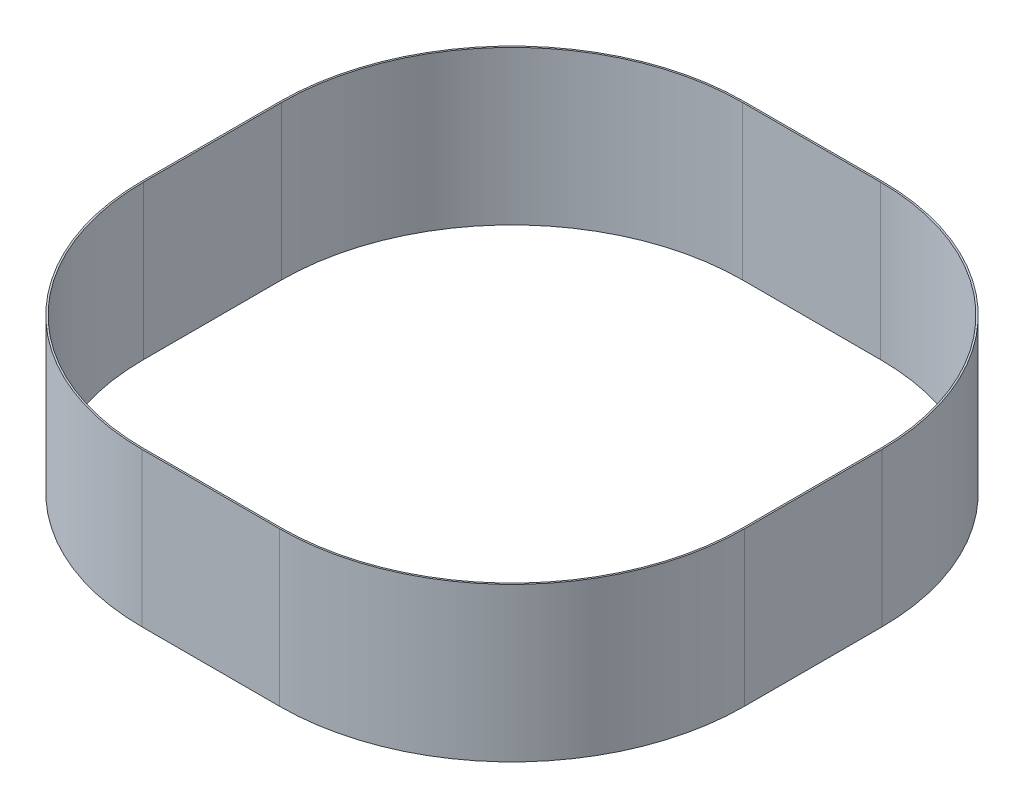
ISO-10303-21;
HEADER;
FILE_DESCRIPTION(('STEP AP214'),'2;1');
FILE_NAME('part.step','',(''),(''),'','','');
FILE_SCHEMA(('AUTOMOTIVE_DESIGN { 1 0 10303 214 1 1 1 1 }'));
ENDSEC;
DATA;
#1=APPLICATION_CONTEXT('core data for automotive mechanical design processes');
#2=APPLICATION_PROTOCOL_DEFINITION('international standard','automotive_design',2000,#1);
#3=PRODUCT_CONTEXT('',#1,'mechanical');
#4=PRODUCT('Part','Part','',(#3));
#5=PRODUCT_RELATED_PRODUCT_CATEGORY('part','',(#4));
#6=PRODUCT_DEFINITION_FORMATION('','',#4);
#7=PRODUCT_DEFINITION_CONTEXT('part definition',#1,'design');
#8=PRODUCT_DEFINITION('design','',#6,#7);
#9=PRODUCT_DEFINITION_SHAPE('','',#8);
#10=(LENGTH_UNIT() NAMED_UNIT(*) SI_UNIT(.MILLI.,.METRE.));
#11=(NAMED_UNIT(*) PLANE_ANGLE_UNIT() SI_UNIT($,.RADIAN.));
#12=(NAMED_UNIT(*) SI_UNIT($,.STERADIAN.) SOLID_ANGLE_UNIT());
#13=UNCERTAINTY_MEASURE_WITH_UNIT(LENGTH_MEASURE(1.E-05),#10,'distance_accuracy_value','');
#14=(GEOMETRIC_REPRESENTATION_CONTEXT(3) GLOBAL_UNCERTAINTY_ASSIGNED_CONTEXT((#13)) GLOBAL_UNIT_ASSIGNED_CONTEXT((#10,
#11,#12)) REPRESENTATION_CONTEXT('',''));
#15=CARTESIAN_POINT('',(0.,0.,0.));
#16=DIRECTION('',(0.,0.,1.));
#17=DIRECTION('',(1.,0.,0.));
#18=AXIS2_PLACEMENT_3D('',#15,#16,#17);
#19=CARTESIAN_POINT('',(-34.13125,76.2,-34.13125));
#20=DIRECTION('',(0.,-1.,0.));
#21=DIRECTION('',(0.,0.,-1.));
#22=AXIS2_PLACEMENT_3D('',#19,#20,#21);
#23=PLANE('',#22);
#24=CARTESIAN_POINT('',(-34.13125,76.2,-34.13125));
#25=DIRECTION('',(0.,1.,0.));
#26=DIRECTION('',(0.,0.,-1.));
#27=AXIS2_PLACEMENT_3D('',#24,#25,#26);
#28=CIRCLE('',#27,115.09375);
#29=CARTESIAN_POINT('',(-34.13125,76.2,-149.225));
#30=VERTEX_POINT('',#29);
#31=CARTESIAN_POINT('',(-149.225,76.2,-34.13125));
#32=VERTEX_POINT('',#31);
#33=EDGE_CURVE('E242',#30,#32,#28,.T.);
#34=ORIENTED_EDGE('',*,*,#33,.T.);
#35=DIRECTION('',(0.,0.,1.));
#36=VECTOR('',#35,1.);
#37=CARTESIAN_POINT('',(-149.225,76.2,34.13125));
#38=LINE('',#37,#36);
#39=CARTESIAN_POINT('',(-149.225,76.2,34.13125));
#40=VERTEX_POINT('',#39);
#41=EDGE_CURVE('E246',#32,#40,#38,.T.);
#42=ORIENTED_EDGE('',*,*,#41,.T.);
#43=CARTESIAN_POINT('',(-34.13125,76.2,34.13125));
#44=DIRECTION('',(0.,1.,0.));
#45=DIRECTION('',(0.,0.,-1.));
#46=AXIS2_PLACEMENT_3D('',#43,#44,#45);
#47=CIRCLE('',#46,115.09375);
#48=CARTESIAN_POINT('',(-34.13125,76.2,149.225));
#49=VERTEX_POINT('',#48);
#50=EDGE_CURVE('E250',#40,#49,#47,.T.);
#51=ORIENTED_EDGE('',*,*,#50,.T.);
#52=DIRECTION('',(1.,0.,0.));
#53=VECTOR('',#52,1.);
#54=CARTESIAN_POINT('',(-34.13125,76.2,149.225));
#55=LINE('',#54,#53);
#56=CARTESIAN_POINT('',(34.13125,76.2,149.225));
#57=VERTEX_POINT('',#56);
#58=EDGE_CURVE('E253',#49,#57,#55,.T.);
#59=ORIENTED_EDGE('',*,*,#58,.T.);
#60=CARTESIAN_POINT('',(34.1312500000001,76.2,34.13125));
#61=DIRECTION('',(0.,1.,0.));
#62=DIRECTION('',(0.,0.,1.));
#63=AXIS2_PLACEMENT_3D('',#60,#61,#62);
#64=CIRCLE('',#63,115.09375);
#65=CARTESIAN_POINT('',(149.225,76.2,34.13125));
#66=VERTEX_POINT('',#65);
#67=EDGE_CURVE('E256',#57,#66,#64,.T.);
#68=ORIENTED_EDGE('',*,*,#67,.T.);
#69=DIRECTION('',(0.,0.,-1.));
#70=VECTOR('',#69,1.);
#71=CARTESIAN_POINT('',(149.225,76.2,34.13125));
#72=LINE('',#71,#70);
#73=CARTESIAN_POINT('',(149.225,76.2,-34.13125));
#74=VERTEX_POINT('',#73);
#75=EDGE_CURVE('E259',#66,#74,#72,.T.);
#76=ORIENTED_EDGE('',*,*,#75,.T.);
#77=CARTESIAN_POINT('',(34.1312500000001,76.2,-34.13125));
#78=DIRECTION('',(0.,1.,0.));
#79=DIRECTION('',(0.,0.,-1.));
#80=AXIS2_PLACEMENT_3D('',#77,#78,#79);
#81=CIRCLE('',#80,115.09375);
#82=CARTESIAN_POINT('',(34.1312500000001,76.2,-149.225));
#83=VERTEX_POINT('',#82);
#84=EDGE_CURVE('E262',#74,#83,#81,.T.);
#85=ORIENTED_EDGE('',*,*,#84,.T.);
#86=DIRECTION('',(-1.,0.,0.));
#87=VECTOR('',#86,1.);
#88=CARTESIAN_POINT('',(-34.13125,76.2,-149.225));
#89=LINE('',#88,#87);
#90=EDGE_CURVE('E265',#83,#30,#89,.T.);
#91=ORIENTED_EDGE('',*,*,#90,.T.);
#92=EDGE_LOOP('',(#34,#42,#51,#59,#68,#76,#85,#91));
#93=FACE_BOUND('',#92,.T.);
#94=CARTESIAN_POINT('',(-34.13125,76.2,34.13125));
#95=DIRECTION('',(0.,1.,0.));
#96=DIRECTION('',(0.,0.,-1.));
#97=AXIS2_PLACEMENT_3D('',#94,#95,#96);
#98=CIRCLE('',#97,114.3);
#99=CARTESIAN_POINT('',(-148.43125,76.2,34.1312499999992));
#100=VERTEX_POINT('',#99);
#101=CARTESIAN_POINT('',(-34.1312499999991,76.2,148.43125));
#102=VERTEX_POINT('',#101);
#103=EDGE_CURVE('E153',#100,#102,#98,.T.);
#104=ORIENTED_EDGE('',*,*,#103,.F.);
#105=DIRECTION('',(0.,0.,1.));
#106=VECTOR('',#105,1.);
#107=CARTESIAN_POINT('',(-148.43125,76.2,34.1312499999992));
#108=LINE('',#107,#106);
#109=CARTESIAN_POINT('',(-148.43125,76.2,-34.1312499999992));
#110=VERTEX_POINT('',#109);
#111=EDGE_CURVE('E194',#110,#100,#108,.T.);
#112=ORIENTED_EDGE('',*,*,#111,.F.);
#113=CARTESIAN_POINT('',(-34.13125,76.2,-34.13125));
#114=DIRECTION('',(0.,1.,0.));
#115=DIRECTION('',(0.,0.,-1.));
#116=AXIS2_PLACEMENT_3D('',#113,#114,#115);
#117=CIRCLE('',#116,114.3);
#118=CARTESIAN_POINT('',(-34.1312499999992,76.2,-148.43125));
#119=VERTEX_POINT('',#118);
#120=EDGE_CURVE('E191',#119,#110,#117,.T.);
#121=ORIENTED_EDGE('',*,*,#120,.F.);
#122=DIRECTION('',(-1.,0.,0.));
#123=VECTOR('',#122,1.);
#124=CARTESIAN_POINT('',(-34.1312499999992,76.2,-148.43125));
#125=LINE('',#124,#123);
#126=CARTESIAN_POINT('',(34.1312499999992,76.2,-148.43125));
#127=VERTEX_POINT('',#126);
#128=EDGE_CURVE('E188',#127,#119,#125,.T.);
#129=ORIENTED_EDGE('',*,*,#128,.F.);
#130=CARTESIAN_POINT('',(34.1312500000001,76.2,-34.13125));
#131=DIRECTION('',(0.,1.,0.));
#132=DIRECTION('',(0.,0.,-1.));
#133=AXIS2_PLACEMENT_3D('',#130,#131,#132);
#134=CIRCLE('',#133,114.3);
#135=CARTESIAN_POINT('',(148.43125,76.2,-34.1312499999992));
#136=VERTEX_POINT('',#135);
#137=EDGE_CURVE('E185',#136,#127,#134,.T.);
#138=ORIENTED_EDGE('',*,*,#137,.F.);
#139=DIRECTION('',(0.,0.,-1.));
#140=VECTOR('',#139,1.);
#141=CARTESIAN_POINT('',(148.43125,76.2,34.1312499999992));
#142=LINE('',#141,#140);
#143=CARTESIAN_POINT('',(148.43125,76.2,34.1312499999992));
#144=VERTEX_POINT('',#143);
#145=EDGE_CURVE('E180',#144,#136,#142,.T.);
#146=ORIENTED_EDGE('',*,*,#145,.F.);
#147=CARTESIAN_POINT('',(34.1312500000001,76.2,34.13125));
#148=DIRECTION('',(0.,1.,0.));
#149=DIRECTION('',(0.,0.,1.));
#150=AXIS2_PLACEMENT_3D('',#147,#148,#149);
#151=CIRCLE('',#150,114.3);
#152=CARTESIAN_POINT('',(34.1312499999992,76.2,148.43125));
#153=VERTEX_POINT('',#152);
#154=EDGE_CURVE('E176',#153,#144,#151,.T.);
#155=ORIENTED_EDGE('',*,*,#154,.F.);
#156=DIRECTION('',(1.,0.,0.));
#157=VECTOR('',#156,1.);
#158=CARTESIAN_POINT('',(-34.1312499999991,76.2,148.43125));
#159=LINE('',#158,#157);
#160=EDGE_CURVE('E162',#102,#153,#159,.T.);
#161=ORIENTED_EDGE('',*,*,#160,.F.);
#162=EDGE_LOOP('',(#104,#112,#121,#129,#138,#146,#155,#161));
#163=FACE_BOUND('',#162,.T.);
#164=ADVANCED_FACE('F39',(#93,#163),#23,.F.);
#165=CARTESIAN_POINT('',(-34.13125,0.,-34.13125));
#166=DIRECTION('',(0.,-1.,0.));
#167=DIRECTION('',(0.,0.,-1.));
#168=AXIS2_PLACEMENT_3D('',#165,#166,#167);
#169=PLANE('',#168);
#170=CARTESIAN_POINT('',(-34.13125,0.,-34.13125));
#171=DIRECTION('',(0.,1.,0.));
#172=DIRECTION('',(0.,0.,-1.));
#173=AXIS2_PLACEMENT_3D('',#170,#171,#172);
#174=CIRCLE('',#173,115.09375);
#175=CARTESIAN_POINT('',(-34.13125,0.,-149.225));
#176=VERTEX_POINT('',#175);
#177=CARTESIAN_POINT('',(-149.225,0.,-34.13125));
#178=VERTEX_POINT('',#177);
#179=EDGE_CURVE('E171',#176,#178,#174,.T.);
#180=ORIENTED_EDGE('',*,*,#179,.F.);
#181=DIRECTION('',(-1.,0.,0.));
#182=VECTOR('',#181,1.);
#183=CARTESIAN_POINT('',(-34.13125,0.,-149.225));
#184=LINE('',#183,#182);
#185=CARTESIAN_POINT('',(34.1312500000001,0.,-149.225));
#186=VERTEX_POINT('',#185);
#187=EDGE_CURVE('E247',#186,#176,#184,.T.);
#188=ORIENTED_EDGE('',*,*,#187,.F.);
#189=CARTESIAN_POINT('',(34.1312500000001,0.,-34.13125));
#190=DIRECTION('',(0.,1.,0.));
#191=DIRECTION('',(0.,0.,-1.));
#192=AXIS2_PLACEMENT_3D('',#189,#190,#191);
#193=CIRCLE('',#192,115.09375);
#194=CARTESIAN_POINT('',(149.225,0.,-34.13125));
#195=VERTEX_POINT('',#194);
#196=EDGE_CURVE('E287',#195,#186,#193,.T.);
#197=ORIENTED_EDGE('',*,*,#196,.F.);
#198=DIRECTION('',(0.,0.,-1.));
#199=VECTOR('',#198,1.);
#200=CARTESIAN_POINT('',(149.225,0.,34.13125));
#201=LINE('',#200,#199);
#202=CARTESIAN_POINT('',(149.225,0.,34.13125));
#203=VERTEX_POINT('',#202);
#204=EDGE_CURVE('E284',#203,#195,#201,.T.);
#205=ORIENTED_EDGE('',*,*,#204,.F.);
#206=CARTESIAN_POINT('',(34.1312500000001,0.,34.13125));
#207=DIRECTION('',(0.,1.,0.));
#208=DIRECTION('',(0.,0.,1.));
#209=AXIS2_PLACEMENT_3D('',#206,#207,#208);
#210=CIRCLE('',#209,115.09375);
#211=CARTESIAN_POINT('',(34.13125,0.,149.225));
#212=VERTEX_POINT('',#211);
#213=EDGE_CURVE('E281',#212,#203,#210,.T.);
#214=ORIENTED_EDGE('',*,*,#213,.F.);
#215=DIRECTION('',(1.,0.,0.));
#216=VECTOR('',#215,1.);
#217=CARTESIAN_POINT('',(-34.13125,0.,149.225));
#218=LINE('',#217,#216);
#219=CARTESIAN_POINT('',(-34.13125,0.,149.225));
#220=VERTEX_POINT('',#219);
#221=EDGE_CURVE('E278',#220,#212,#218,.T.);
#222=ORIENTED_EDGE('',*,*,#221,.F.);
#223=CARTESIAN_POINT('',(-34.13125,0.,34.13125));
#224=DIRECTION('',(0.,1.,0.));
#225=DIRECTION('',(0.,0.,-1.));
#226=AXIS2_PLACEMENT_3D('',#223,#224,#225);
#227=CIRCLE('',#226,115.09375);
#228=CARTESIAN_POINT('',(-149.225,0.,34.13125));
#229=VERTEX_POINT('',#228);
#230=EDGE_CURVE('E275',#229,#220,#227,.T.);
#231=ORIENTED_EDGE('',*,*,#230,.F.);
#232=DIRECTION('',(0.,0.,1.));
#233=VECTOR('',#232,1.);
#234=CARTESIAN_POINT('',(-149.225,0.,34.13125));
#235=LINE('',#234,#233);
#236=EDGE_CURVE('E272',#178,#229,#235,.T.);
#237=ORIENTED_EDGE('',*,*,#236,.F.);
#238=EDGE_LOOP('',(#180,#188,#197,#205,#214,#222,#231,#237));
#239=FACE_BOUND('',#238,.T.);
#240=DIRECTION('',(0.,0.,1.));
#241=VECTOR('',#240,1.);
#242=CARTESIAN_POINT('',(-148.43125,0.,34.1312499999992));
#243=LINE('',#242,#241);
#244=CARTESIAN_POINT('',(-148.43125,0.,-34.1312499999992));
#245=VERTEX_POINT('',#244);
#246=CARTESIAN_POINT('',(-148.43125,0.,34.1312499999992));
#247=VERTEX_POINT('',#246);
#248=EDGE_CURVE('E163',#245,#247,#243,.T.);
#249=ORIENTED_EDGE('',*,*,#248,.T.);
#250=CARTESIAN_POINT('',(-34.13125,0.,34.13125));
#251=DIRECTION('',(0.,1.,0.));
#252=DIRECTION('',(0.,0.,-1.));
#253=AXIS2_PLACEMENT_3D('',#250,#251,#252);
#254=CIRCLE('',#253,114.3);
#255=CARTESIAN_POINT('',(-34.1312499999991,0.,148.43125));
#256=VERTEX_POINT('',#255);
#257=EDGE_CURVE('E63',#247,#256,#254,.T.);
#258=ORIENTED_EDGE('',*,*,#257,.T.);
#259=DIRECTION('',(1.,0.,0.));
#260=VECTOR('',#259,1.);
#261=CARTESIAN_POINT('',(-34.1312499999991,0.,148.43125));
#262=LINE('',#261,#260);
#263=CARTESIAN_POINT('',(34.1312499999992,0.,148.43125));
#264=VERTEX_POINT('',#263);
#265=EDGE_CURVE('E169',#256,#264,#262,.T.);
#266=ORIENTED_EDGE('',*,*,#265,.T.);
#267=CARTESIAN_POINT('',(34.1312500000001,0.,34.13125));
#268=DIRECTION('',(0.,1.,0.));
#269=DIRECTION('',(0.,0.,1.));
#270=AXIS2_PLACEMENT_3D('',#267,#268,#269);
#271=CIRCLE('',#270,114.3);
#272=CARTESIAN_POINT('',(148.43125,0.,34.1312499999992));
#273=VERTEX_POINT('',#272);
#274=EDGE_CURVE('E201',#264,#273,#271,.T.);
#275=ORIENTED_EDGE('',*,*,#274,.T.);
#276=DIRECTION('',(0.,0.,-1.));
#277=VECTOR('',#276,1.);
#278=CARTESIAN_POINT('',(148.43125,0.,34.1312499999992));
#279=LINE('',#278,#277);
#280=CARTESIAN_POINT('',(148.43125,0.,-34.1312499999992));
#281=VERTEX_POINT('',#280);
#282=EDGE_CURVE('E205',#273,#281,#279,.T.);
#283=ORIENTED_EDGE('',*,*,#282,.T.);
#284=CARTESIAN_POINT('',(34.1312500000001,0.,-34.13125));
#285=DIRECTION('',(0.,1.,0.));
#286=DIRECTION('',(0.,0.,-1.));
#287=AXIS2_PLACEMENT_3D('',#284,#285,#286);
#288=CIRCLE('',#287,114.3);
#289=CARTESIAN_POINT('',(34.1312499999992,0.,-148.43125));
#290=VERTEX_POINT('',#289);
#291=EDGE_CURVE('E209',#281,#290,#288,.T.);
#292=ORIENTED_EDGE('',*,*,#291,.T.);
#293=DIRECTION('',(-1.,0.,0.));
#294=VECTOR('',#293,1.);
#295=CARTESIAN_POINT('',(-34.1312499999992,0.,-148.43125));
#296=LINE('',#295,#294);
#297=CARTESIAN_POINT('',(-34.1312499999992,0.,-148.43125));
#298=VERTEX_POINT('',#297);
#299=EDGE_CURVE('E213',#290,#298,#296,.T.);
#300=ORIENTED_EDGE('',*,*,#299,.T.);
#301=CARTESIAN_POINT('',(-34.13125,0.,-34.13125));
#302=DIRECTION('',(0.,1.,0.));
#303=DIRECTION('',(0.,0.,-1.));
#304=AXIS2_PLACEMENT_3D('',#301,#302,#303);
#305=CIRCLE('',#304,114.3);
#306=EDGE_CURVE('E217',#298,#245,#305,.T.);
#307=ORIENTED_EDGE('',*,*,#306,.T.);
#308=EDGE_LOOP('',(#249,#258,#266,#275,#283,#292,#300,#307));
#309=FACE_BOUND('',#308,.T.);
#310=ADVANCED_FACE('F326',(#239,#309),#169,.T.);
#311=CARTESIAN_POINT('',(-34.13125,76.2,-34.13125));
#312=DIRECTION('',(0.,-1.,0.));
#313=DIRECTION('',(0.,0.,-1.));
#314=AXIS2_PLACEMENT_3D('',#311,#312,#313);
#315=CYLINDRICAL_SURFACE('',#314,115.09375);
#316=ORIENTED_EDGE('',*,*,#179,.T.);
#317=DIRECTION('',(0.,-1.,0.));
#318=VECTOR('',#317,1.);
#319=CARTESIAN_POINT('',(-149.225,76.2,-34.13125));
#320=LINE('',#319,#318);
#321=EDGE_CURVE('E11',#32,#178,#320,.T.);
#322=ORIENTED_EDGE('',*,*,#321,.F.);
#323=ORIENTED_EDGE('',*,*,#33,.F.);
#324=DIRECTION('',(0.,-1.,0.));
#325=VECTOR('',#324,1.);
#326=CARTESIAN_POINT('',(-34.13125,76.2,-149.225));
#327=LINE('',#326,#325);
#328=EDGE_CURVE('E268',#30,#176,#327,.T.);
#329=ORIENTED_EDGE('',*,*,#328,.T.);
#330=EDGE_LOOP('',(#316,#322,#323,#329));
#331=FACE_BOUND('',#330,.T.);
#332=ADVANCED_FACE('F41',(#331),#315,.T.);
#333=CARTESIAN_POINT('',(-149.225,76.2,34.13125));
#334=DIRECTION('',(1.,0.,0.));
#335=DIRECTION('',(0.,0.,-1.));
#336=AXIS2_PLACEMENT_3D('',#333,#334,#335);
#337=PLANE('',#336);
#338=ORIENTED_EDGE('',*,*,#236,.T.);
#339=DIRECTION('',(0.,-1.,0.));
#340=VECTOR('',#339,1.);
#341=CARTESIAN_POINT('',(-149.225,76.2,34.13125));
#342=LINE('',#341,#340);
#343=EDGE_CURVE('E48',#40,#229,#342,.T.);
#344=ORIENTED_EDGE('',*,*,#343,.F.);
#345=ORIENTED_EDGE('',*,*,#41,.F.);
#346=ORIENTED_EDGE('',*,*,#321,.T.);
#347=EDGE_LOOP('',(#338,#344,#345,#346));
#348=FACE_BOUND('',#347,.T.);
#349=ADVANCED_FACE('F343',(#348),#337,.F.);
#350=CARTESIAN_POINT('',(-34.13125,76.2,34.13125));
#351=DIRECTION('',(0.,-1.,0.));
#352=DIRECTION('',(0.,0.,-1.));
#353=AXIS2_PLACEMENT_3D('',#350,#351,#352);
#354=CYLINDRICAL_SURFACE('',#353,115.09375);
#355=ORIENTED_EDGE('',*,*,#230,.T.);
#356=DIRECTION('',(0.,-1.,0.));
#357=VECTOR('',#356,1.);
#358=CARTESIAN_POINT('',(-34.13125,76.2,149.225));
#359=LINE('',#358,#357);
#360=EDGE_CURVE('E311',#49,#220,#359,.T.);
#361=ORIENTED_EDGE('',*,*,#360,.F.);
#362=ORIENTED_EDGE('',*,*,#50,.F.);
#363=ORIENTED_EDGE('',*,*,#343,.T.);
#364=EDGE_LOOP('',(#355,#361,#362,#363));
#365=FACE_BOUND('',#364,.T.);
#366=ADVANCED_FACE('F320',(#365),#354,.T.);
#367=CARTESIAN_POINT('',(-34.13125,76.2,149.225));
#368=DIRECTION('',(0.,0.,-1.));
#369=DIRECTION('',(-1.,0.,0.));
#370=AXIS2_PLACEMENT_3D('',#367,#368,#369);
#371=PLANE('',#370);
#372=ORIENTED_EDGE('',*,*,#221,.T.);
#373=DIRECTION('',(0.,-1.,0.));
#374=VECTOR('',#373,1.);
#375=CARTESIAN_POINT('',(34.13125,76.2,149.225));
#376=LINE('',#375,#374);
#377=EDGE_CURVE('E307',#57,#212,#376,.T.);
#378=ORIENTED_EDGE('',*,*,#377,.F.);
#379=ORIENTED_EDGE('',*,*,#58,.F.);
#380=ORIENTED_EDGE('',*,*,#360,.T.);
#381=EDGE_LOOP('',(#372,#378,#379,#380));
#382=FACE_BOUND('',#381,.T.);
#383=ADVANCED_FACE('F332',(#382),#371,.F.);
#384=CARTESIAN_POINT('',(34.1312500000001,76.2,34.13125));
#385=DIRECTION('',(0.,-1.,0.));
#386=DIRECTION('',(0.,0.,-1.));
#387=AXIS2_PLACEMENT_3D('',#384,#385,#386);
#388=CYLINDRICAL_SURFACE('',#387,115.09375);
#389=ORIENTED_EDGE('',*,*,#213,.T.);
#390=DIRECTION('',(0.,-1.,0.));
#391=VECTOR('',#390,1.);
#392=CARTESIAN_POINT('',(149.225,76.2,34.13125));
#393=LINE('',#392,#391);
#394=EDGE_CURVE('E303',#66,#203,#393,.T.);
#395=ORIENTED_EDGE('',*,*,#394,.F.);
#396=ORIENTED_EDGE('',*,*,#67,.F.);
#397=ORIENTED_EDGE('',*,*,#377,.T.);
#398=EDGE_LOOP('',(#389,#395,#396,#397));
#399=FACE_BOUND('',#398,.T.);
#400=ADVANCED_FACE('F336',(#399),#388,.T.);
#401=CARTESIAN_POINT('',(149.225,76.2,34.13125));
#402=DIRECTION('',(-1.,0.,0.));
#403=DIRECTION('',(0.,0.,1.));
#404=AXIS2_PLACEMENT_3D('',#401,#402,#403);
#405=PLANE('',#404);
#406=ORIENTED_EDGE('',*,*,#204,.T.);
#407=DIRECTION('',(0.,-1.,0.));
#408=VECTOR('',#407,1.);
#409=CARTESIAN_POINT('',(149.225,76.2,-34.13125));
#410=LINE('',#409,#408);
#411=EDGE_CURVE('E299',#74,#195,#410,.T.);
#412=ORIENTED_EDGE('',*,*,#411,.F.);
#413=ORIENTED_EDGE('',*,*,#75,.F.);
#414=ORIENTED_EDGE('',*,*,#394,.T.);
#415=EDGE_LOOP('',(#406,#412,#413,#414));
#416=FACE_BOUND('',#415,.T.);
#417=ADVANCED_FACE('F356',(#416),#405,.F.);
#418=CARTESIAN_POINT('',(34.1312500000001,76.2,-34.13125));
#419=DIRECTION('',(0.,-1.,0.));
#420=DIRECTION('',(0.,0.,-1.));
#421=AXIS2_PLACEMENT_3D('',#418,#419,#420);
#422=CYLINDRICAL_SURFACE('',#421,115.09375);
#423=ORIENTED_EDGE('',*,*,#196,.T.);
#424=DIRECTION('',(0.,-1.,0.));
#425=VECTOR('',#424,1.);
#426=CARTESIAN_POINT('',(34.1312500000001,76.2,-149.225));
#427=LINE('',#426,#425);
#428=EDGE_CURVE('E295',#83,#186,#427,.T.);
#429=ORIENTED_EDGE('',*,*,#428,.F.);
#430=ORIENTED_EDGE('',*,*,#84,.F.);
#431=ORIENTED_EDGE('',*,*,#411,.T.);
#432=EDGE_LOOP('',(#423,#429,#430,#431));
#433=FACE_BOUND('',#432,.T.);
#434=ADVANCED_FACE('F354',(#433),#422,.T.);
#435=CARTESIAN_POINT('',(-34.13125,76.2,-149.225));
#436=DIRECTION('',(0.,0.,1.));
#437=DIRECTION('',(1.,0.,0.));
#438=AXIS2_PLACEMENT_3D('',#435,#436,#437);
#439=PLANE('',#438);
#440=ORIENTED_EDGE('',*,*,#187,.T.);
#441=ORIENTED_EDGE('',*,*,#328,.F.);
#442=ORIENTED_EDGE('',*,*,#90,.F.);
#443=ORIENTED_EDGE('',*,*,#428,.T.);
#444=EDGE_LOOP('',(#440,#441,#442,#443));
#445=FACE_BOUND('',#444,.T.);
#446=ADVANCED_FACE('F349',(#445),#439,.F.);
#447=CARTESIAN_POINT('',(-34.13125,76.2,34.13125));
#448=DIRECTION('',(0.,-1.,0.));
#449=DIRECTION('',(0.,0.,-1.));
#450=AXIS2_PLACEMENT_3D('',#447,#448,#449);
#451=CYLINDRICAL_SURFACE('',#450,114.3);
#452=ORIENTED_EDGE('',*,*,#257,.F.);
#453=DIRECTION('',(0.,-1.,0.));
#454=VECTOR('',#453,1.);
#455=CARTESIAN_POINT('',(-148.43125,76.2,34.1312499999992));
#456=LINE('',#455,#454);
#457=EDGE_CURVE('E157',#100,#247,#456,.T.);
#458=ORIENTED_EDGE('',*,*,#457,.F.);
#459=ORIENTED_EDGE('',*,*,#103,.T.);
#460=DIRECTION('',(0.,-1.,0.));
#461=VECTOR('',#460,1.);
#462=CARTESIAN_POINT('',(-34.1312499999991,76.2,148.43125));
#463=LINE('',#462,#461);
#464=EDGE_CURVE('E156',#102,#256,#463,.T.);
#465=ORIENTED_EDGE('',*,*,#464,.T.);
#466=EDGE_LOOP('',(#452,#458,#459,#465));
#467=FACE_BOUND('',#466,.T.);
#468=ADVANCED_FACE('F155',(#467),#451,.F.);
#469=CARTESIAN_POINT('',(-34.1312499999991,76.2,148.43125));
#470=DIRECTION('',(0.,0.,-1.));
#471=DIRECTION('',(-1.,0.,0.));
#472=AXIS2_PLACEMENT_3D('',#469,#470,#471);
#473=PLANE('',#472);
#474=ORIENTED_EDGE('',*,*,#265,.F.);
#475=ORIENTED_EDGE('',*,*,#464,.F.);
#476=ORIENTED_EDGE('',*,*,#160,.T.);
#477=DIRECTION('',(0.,-1.,0.));
#478=VECTOR('',#477,1.);
#479=CARTESIAN_POINT('',(34.1312499999992,76.2,148.43125));
#480=LINE('',#479,#478);
#481=EDGE_CURVE('E172',#153,#264,#480,.T.);
#482=ORIENTED_EDGE('',*,*,#481,.T.);
#483=EDGE_LOOP('',(#474,#475,#476,#482));
#484=FACE_BOUND('',#483,.T.);
#485=ADVANCED_FACE('F166',(#484),#473,.T.);
#486=CARTESIAN_POINT('',(34.1312500000001,76.2,34.13125));
#487=DIRECTION('',(0.,-1.,0.));
#488=DIRECTION('',(0.,0.,-1.));
#489=AXIS2_PLACEMENT_3D('',#486,#487,#488);
#490=CYLINDRICAL_SURFACE('',#489,114.3);
#491=ORIENTED_EDGE('',*,*,#274,.F.);
#492=ORIENTED_EDGE('',*,*,#481,.F.);
#493=ORIENTED_EDGE('',*,*,#154,.T.);
#494=DIRECTION('',(0.,-1.,0.));
#495=VECTOR('',#494,1.);
#496=CARTESIAN_POINT('',(148.43125,76.2,34.1312499999992));
#497=LINE('',#496,#495);
#498=EDGE_CURVE('E237',#144,#273,#497,.T.);
#499=ORIENTED_EDGE('',*,*,#498,.T.);
#500=EDGE_LOOP('',(#491,#492,#493,#499));
#501=FACE_BOUND('',#500,.T.);
#502=ADVANCED_FACE('F381',(#501),#490,.F.);
#503=CARTESIAN_POINT('',(148.43125,76.2,34.1312499999992));
#504=DIRECTION('',(-1.,0.,0.));
#505=DIRECTION('',(0.,0.,1.));
#506=AXIS2_PLACEMENT_3D('',#503,#504,#505);
#507=PLANE('',#506);
#508=ORIENTED_EDGE('',*,*,#282,.F.);
#509=ORIENTED_EDGE('',*,*,#498,.F.);
#510=ORIENTED_EDGE('',*,*,#145,.T.);
#511=DIRECTION('',(0.,-1.,0.));
#512=VECTOR('',#511,1.);
#513=CARTESIAN_POINT('',(148.43125,76.2,-34.1312499999992));
#514=LINE('',#513,#512);
#515=EDGE_CURVE('E234',#136,#281,#514,.T.);
#516=ORIENTED_EDGE('',*,*,#515,.T.);
#517=EDGE_LOOP('',(#508,#509,#510,#516));
#518=FACE_BOUND('',#517,.T.);
#519=ADVANCED_FACE('F385',(#518),#507,.T.);
#520=CARTESIAN_POINT('',(34.1312500000001,76.2,-34.13125));
#521=DIRECTION('',(0.,-1.,0.));
#522=DIRECTION('',(0.,0.,-1.));
#523=AXIS2_PLACEMENT_3D('',#520,#521,#522);
#524=CYLINDRICAL_SURFACE('',#523,114.3);
#525=ORIENTED_EDGE('',*,*,#291,.F.);
#526=ORIENTED_EDGE('',*,*,#515,.F.);
#527=ORIENTED_EDGE('',*,*,#137,.T.);
#528=DIRECTION('',(0.,-1.,0.));
#529=VECTOR('',#528,1.);
#530=CARTESIAN_POINT('',(34.1312499999992,76.2,-148.43125));
#531=LINE('',#530,#529);
#532=EDGE_CURVE('E231',#127,#290,#531,.T.);
#533=ORIENTED_EDGE('',*,*,#532,.T.);
#534=EDGE_LOOP('',(#525,#526,#527,#533));
#535=FACE_BOUND('',#534,.T.);
#536=ADVANCED_FACE('F391',(#535),#524,.F.);
#537=CARTESIAN_POINT('',(-34.1312499999992,76.2,-148.43125));
#538=DIRECTION('',(0.,0.,1.));
#539=DIRECTION('',(1.,0.,0.));
#540=AXIS2_PLACEMENT_3D('',#537,#538,#539);
#541=PLANE('',#540);
#542=ORIENTED_EDGE('',*,*,#299,.F.);
#543=ORIENTED_EDGE('',*,*,#532,.F.);
#544=ORIENTED_EDGE('',*,*,#128,.T.);
#545=DIRECTION('',(0.,-1.,0.));
#546=VECTOR('',#545,1.);
#547=CARTESIAN_POINT('',(-34.1312499999992,76.2,-148.43125));
#548=LINE('',#547,#546);
#549=EDGE_CURVE('E228',#119,#298,#548,.T.);
#550=ORIENTED_EDGE('',*,*,#549,.T.);
#551=EDGE_LOOP('',(#542,#543,#544,#550));
#552=FACE_BOUND('',#551,.T.);
#553=ADVANCED_FACE('F395',(#552),#541,.T.);
#554=CARTESIAN_POINT('',(-34.13125,76.2,-34.13125));
#555=DIRECTION('',(0.,-1.,0.));
#556=DIRECTION('',(0.,0.,-1.));
#557=AXIS2_PLACEMENT_3D('',#554,#555,#556);
#558=CYLINDRICAL_SURFACE('',#557,114.3);
#559=ORIENTED_EDGE('',*,*,#306,.F.);
#560=ORIENTED_EDGE('',*,*,#549,.F.);
#561=ORIENTED_EDGE('',*,*,#120,.T.);
#562=DIRECTION('',(0.,-1.,0.));
#563=VECTOR('',#562,1.);
#564=CARTESIAN_POINT('',(-148.43125,76.2,-34.1312499999992));
#565=LINE('',#564,#563);
#566=EDGE_CURVE('E55',#110,#245,#565,.T.);
#567=ORIENTED_EDGE('',*,*,#566,.T.);
#568=EDGE_LOOP('',(#559,#560,#561,#567));
#569=FACE_BOUND('',#568,.T.);
#570=ADVANCED_FACE('F399',(#569),#558,.F.);
#571=CARTESIAN_POINT('',(-148.43125,76.2,34.1312499999992));
#572=DIRECTION('',(1.,0.,0.));
#573=DIRECTION('',(0.,0.,-1.));
#574=AXIS2_PLACEMENT_3D('',#571,#572,#573);
#575=PLANE('',#574);
#576=ORIENTED_EDGE('',*,*,#248,.F.);
#577=ORIENTED_EDGE('',*,*,#566,.F.);
#578=ORIENTED_EDGE('',*,*,#111,.T.);
#579=ORIENTED_EDGE('',*,*,#457,.T.);
#580=EDGE_LOOP('',(#576,#577,#578,#579));
#581=FACE_BOUND('',#580,.T.);
#582=ADVANCED_FACE('F403',(#581),#575,.T.);
#583=CLOSED_SHELL('',(#164,#310,#332,#349,#366,#383,#400,#417,#434,#446,#468,#485,#502,#519,
#536,#553,#570,#582));
#584=MANIFOLD_SOLID_BREP('B2',#583);
#585=ADVANCED_BREP_SHAPE_REPRESENTATION('',(#18,#584),#14);
#586=SHAPE_DEFINITION_REPRESENTATION(#9,#585);
ENDSEC;
END-ISO-10303-21;
